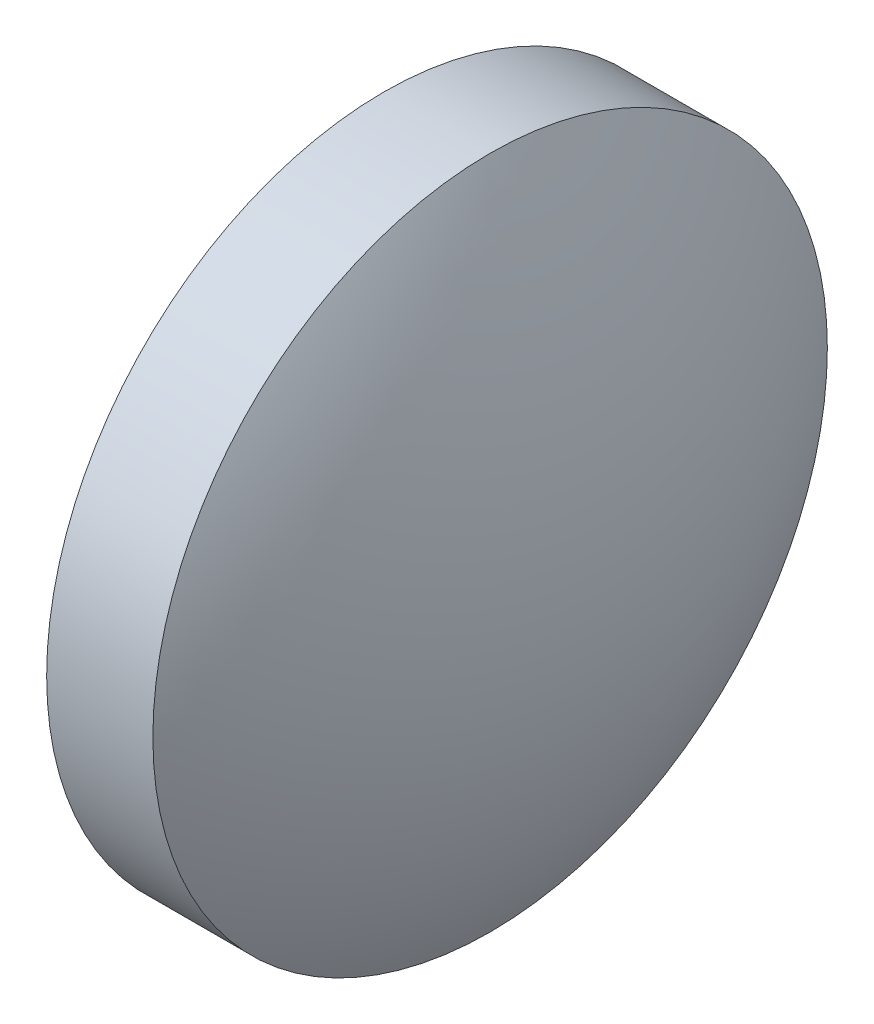
ISO-10303-21;
HEADER;
FILE_DESCRIPTION(('STEP AP214'),'2;1');
FILE_NAME('part.step','',(''),(''),'','','');
FILE_SCHEMA(('AUTOMOTIVE_DESIGN { 1 0 10303 214 1 1 1 1 }'));
ENDSEC;
DATA;
#1=APPLICATION_CONTEXT('core data for automotive mechanical design processes');
#2=APPLICATION_PROTOCOL_DEFINITION('international standard','automotive_design',2000,#1);
#3=PRODUCT_CONTEXT('',#1,'mechanical');
#4=PRODUCT('Part','Part','',(#3));
#5=PRODUCT_RELATED_PRODUCT_CATEGORY('part','',(#4));
#6=PRODUCT_DEFINITION_FORMATION('','',#4);
#7=PRODUCT_DEFINITION_CONTEXT('part definition',#1,'design');
#8=PRODUCT_DEFINITION('design','',#6,#7);
#9=PRODUCT_DEFINITION_SHAPE('','',#8);
#10=(LENGTH_UNIT() NAMED_UNIT(*) SI_UNIT(.MILLI.,.METRE.));
#11=(NAMED_UNIT(*) PLANE_ANGLE_UNIT() SI_UNIT($,.RADIAN.));
#12=(NAMED_UNIT(*) SI_UNIT($,.STERADIAN.) SOLID_ANGLE_UNIT());
#13=UNCERTAINTY_MEASURE_WITH_UNIT(LENGTH_MEASURE(1.E-05),#10,'distance_accuracy_value','');
#14=(GEOMETRIC_REPRESENTATION_CONTEXT(3) GLOBAL_UNCERTAINTY_ASSIGNED_CONTEXT((#13)) GLOBAL_UNIT_ASSIGNED_CONTEXT((#10,
#11,#12)) REPRESENTATION_CONTEXT('',''));
#15=CARTESIAN_POINT('',(0.,0.,0.));
#16=DIRECTION('',(0.,0.,1.));
#17=DIRECTION('',(1.,0.,0.));
#18=AXIS2_PLACEMENT_3D('',#15,#16,#17);
#19=CARTESIAN_POINT('',(53.3905316379707,24.3072231210854,0.));
#20=DIRECTION('',(-1.,0.,0.));
#21=DIRECTION('',(0.,1.,0.));
#22=AXIS2_PLACEMENT_3D('',#19,#20,#21);
#23=SPHERICAL_SURFACE('',#22,12.842524968011);
#24=CARTESIAN_POINT('',(42.227614797681,24.3072231210854,0.));
#25=DIRECTION('',(-1.,0.,0.));
#26=DIRECTION('',(0.,0.,1.));
#27=AXIS2_PLACEMENT_3D('',#24,#25,#26);
#28=CIRCLE('',#27,6.34978229317851);
#29=CARTESIAN_POINT('',(42.227614797681,24.3072231210854,6.34978229317851));
#30=VERTEX_POINT('',#29);
#31=EDGE_CURVE('E46',#30,#30,#28,.T.);
#32=ORIENTED_EDGE('',*,*,#31,.T.);
#33=EDGE_LOOP('',(#32));
#34=FACE_BOUND('',#33,.T.);
#35=ADVANCED_FACE('F39',(#34),#23,.T.);
#36=CARTESIAN_POINT('',(33.0646979573914,24.3072231210854,0.));
#37=DIRECTION('',(-1.,0.,0.));
#38=DIRECTION('',(0.,-1.,0.));
#39=AXIS2_PLACEMENT_3D('',#36,#37,#38);
#40=SPHERICAL_SURFACE('',#39,12.842524968011);
#41=CARTESIAN_POINT('',(44.227614797681,24.3072231210854,0.));
#42=DIRECTION('',(-1.,0.,0.));
#43=DIRECTION('',(0.,0.,1.));
#44=AXIS2_PLACEMENT_3D('',#41,#42,#43);
#45=CIRCLE('',#44,6.34978229317851);
#46=CARTESIAN_POINT('',(44.227614797681,24.3072231210854,6.34978229317851));
#47=VERTEX_POINT('',#46);
#48=EDGE_CURVE('E10',#47,#47,#45,.T.);
#49=ORIENTED_EDGE('',*,*,#48,.F.);
#50=EDGE_LOOP('',(#49));
#51=FACE_BOUND('',#50,.T.);
#52=ADVANCED_FACE('F56',(#51),#40,.T.);
#53=CARTESIAN_POINT('',(39.6513412008631,24.3072231210854,0.));
#54=DIRECTION('',(-1.,0.,0.));
#55=DIRECTION('',(0.,0.,1.));
#56=AXIS2_PLACEMENT_3D('',#53,#54,#55);
#57=CYLINDRICAL_SURFACE('',#56,6.34978229317851);
#58=ORIENTED_EDGE('',*,*,#48,.T.);
#59=EDGE_LOOP('',(#58));
#60=FACE_BOUND('',#59,.T.);
#61=ORIENTED_EDGE('',*,*,#31,.F.);
#62=EDGE_LOOP('',(#61));
#63=FACE_BOUND('',#62,.T.);
#64=ADVANCED_FACE('F54',(#60,#63),#57,.T.);
#65=CLOSED_SHELL('',(#35,#52,#64));
#66=MANIFOLD_SOLID_BREP('B2',#65);
#67=ADVANCED_BREP_SHAPE_REPRESENTATION('',(#18,#66),#14);
#68=SHAPE_DEFINITION_REPRESENTATION(#9,#67);
ENDSEC;
END-ISO-10303-21;
